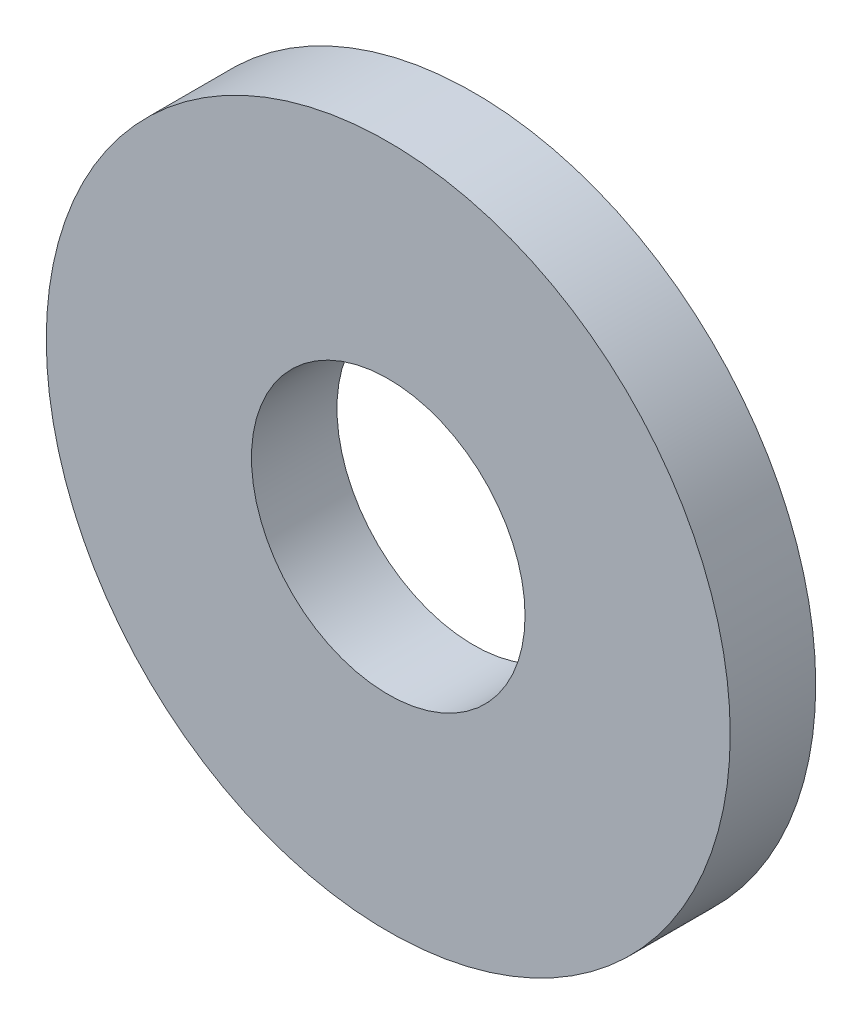
ISO-10303-21;
HEADER;
FILE_DESCRIPTION(('STEP AP214'),'2;1');
FILE_NAME('part.step','',(''),(''),'','','');
FILE_SCHEMA(('AUTOMOTIVE_DESIGN { 1 0 10303 214 1 1 1 1 }'));
ENDSEC;
DATA;
#1=APPLICATION_CONTEXT('core data for automotive mechanical design processes');
#2=APPLICATION_PROTOCOL_DEFINITION('international standard','automotive_design',2000,#1);
#3=PRODUCT_CONTEXT('',#1,'mechanical');
#4=PRODUCT('Part','Part','',(#3));
#5=PRODUCT_RELATED_PRODUCT_CATEGORY('part','',(#4));
#6=PRODUCT_DEFINITION_FORMATION('','',#4);
#7=PRODUCT_DEFINITION_CONTEXT('part definition',#1,'design');
#8=PRODUCT_DEFINITION('design','',#6,#7);
#9=PRODUCT_DEFINITION_SHAPE('','',#8);
#10=(LENGTH_UNIT() NAMED_UNIT(*) SI_UNIT(.MILLI.,.METRE.));
#11=(NAMED_UNIT(*) PLANE_ANGLE_UNIT() SI_UNIT($,.RADIAN.));
#12=(NAMED_UNIT(*) SI_UNIT($,.STERADIAN.) SOLID_ANGLE_UNIT());
#13=UNCERTAINTY_MEASURE_WITH_UNIT(LENGTH_MEASURE(1.E-05),#10,'distance_accuracy_value','');
#14=(GEOMETRIC_REPRESENTATION_CONTEXT(3) GLOBAL_UNCERTAINTY_ASSIGNED_CONTEXT((#13)) GLOBAL_UNIT_ASSIGNED_CONTEXT((#10,
#11,#12)) REPRESENTATION_CONTEXT('',''));
#15=CARTESIAN_POINT('',(0.,0.,0.));
#16=DIRECTION('',(0.,0.,1.));
#17=DIRECTION('',(1.,0.,0.));
#18=AXIS2_PLACEMENT_3D('',#15,#16,#17);
#19=CARTESIAN_POINT('',(0.,0.,1.));
#20=DIRECTION('',(0.,0.,1.));
#21=DIRECTION('',(1.,0.,0.));
#22=AXIS2_PLACEMENT_3D('',#19,#20,#21);
#23=PLANE('',#22);
#24=CARTESIAN_POINT('',(0.,0.,1.));
#25=DIRECTION('',(0.,0.,1.));
#26=DIRECTION('',(1.,0.,0.));
#27=AXIS2_PLACEMENT_3D('',#24,#25,#26);
#28=CIRCLE('',#27,4.);
#29=CARTESIAN_POINT('',(4.,0.,1.));
#30=VERTEX_POINT('',#29);
#31=EDGE_CURVE('E10',#30,#30,#28,.T.);
#32=ORIENTED_EDGE('',*,*,#31,.T.);
#33=EDGE_LOOP('',(#32));
#34=FACE_BOUND('',#33,.T.);
#35=CARTESIAN_POINT('',(0.,0.,1.));
#36=DIRECTION('',(0.,0.,1.));
#37=DIRECTION('',(1.,0.,0.));
#38=AXIS2_PLACEMENT_3D('',#35,#36,#37);
#39=CIRCLE('',#38,1.6);
#40=CARTESIAN_POINT('',(1.6,0.,1.));
#41=VERTEX_POINT('',#40);
#42=EDGE_CURVE('E35',#41,#41,#39,.T.);
#43=ORIENTED_EDGE('',*,*,#42,.F.);
#44=EDGE_LOOP('',(#43));
#45=FACE_BOUND('',#44,.T.);
#46=ADVANCED_FACE('F24',(#34,#45),#23,.T.);
#47=CARTESIAN_POINT('',(0.,0.,0.));
#48=DIRECTION('',(0.,0.,1.));
#49=DIRECTION('',(1.,0.,0.));
#50=AXIS2_PLACEMENT_3D('',#47,#48,#49);
#51=PLANE('',#50);
#52=CARTESIAN_POINT('',(0.,0.,0.));
#53=DIRECTION('',(0.,0.,1.));
#54=DIRECTION('',(1.,0.,0.));
#55=AXIS2_PLACEMENT_3D('',#52,#53,#54);
#56=CIRCLE('',#55,4.);
#57=CARTESIAN_POINT('',(4.,0.,0.));
#58=VERTEX_POINT('',#57);
#59=EDGE_CURVE('E31',#58,#58,#56,.T.);
#60=ORIENTED_EDGE('',*,*,#59,.F.);
#61=EDGE_LOOP('',(#60));
#62=FACE_BOUND('',#61,.T.);
#63=CARTESIAN_POINT('',(0.,0.,0.));
#64=DIRECTION('',(0.,0.,1.));
#65=DIRECTION('',(1.,0.,0.));
#66=AXIS2_PLACEMENT_3D('',#63,#64,#65);
#67=CIRCLE('',#66,1.6);
#68=CARTESIAN_POINT('',(1.6,0.,0.));
#69=VERTEX_POINT('',#68);
#70=EDGE_CURVE('E39',#69,#69,#67,.T.);
#71=ORIENTED_EDGE('',*,*,#70,.T.);
#72=EDGE_LOOP('',(#71));
#73=FACE_BOUND('',#72,.T.);
#74=ADVANCED_FACE('F45',(#62,#73),#51,.F.);
#75=CARTESIAN_POINT('',(0.,0.,1.));
#76=DIRECTION('',(0.,0.,-1.));
#77=DIRECTION('',(-1.,0.,0.));
#78=AXIS2_PLACEMENT_3D('',#75,#76,#77);
#79=CYLINDRICAL_SURFACE('',#78,4.);
#80=ORIENTED_EDGE('',*,*,#31,.F.);
#81=EDGE_LOOP('',(#80));
#82=FACE_BOUND('',#81,.T.);
#83=ORIENTED_EDGE('',*,*,#59,.T.);
#84=EDGE_LOOP('',(#83));
#85=FACE_BOUND('',#84,.T.);
#86=ADVANCED_FACE('F26',(#82,#85),#79,.T.);
#87=CARTESIAN_POINT('',(0.,0.,1.));
#88=DIRECTION('',(0.,0.,-1.));
#89=DIRECTION('',(-1.,0.,0.));
#90=AXIS2_PLACEMENT_3D('',#87,#88,#89);
#91=CYLINDRICAL_SURFACE('',#90,1.6);
#92=ORIENTED_EDGE('',*,*,#42,.T.);
#93=EDGE_LOOP('',(#92));
#94=FACE_BOUND('',#93,.T.);
#95=ORIENTED_EDGE('',*,*,#70,.F.);
#96=EDGE_LOOP('',(#95));
#97=FACE_BOUND('',#96,.T.);
#98=ADVANCED_FACE('F47',(#94,#97),#91,.F.);
#99=CLOSED_SHELL('',(#46,#74,#86,#98));
#100=MANIFOLD_SOLID_BREP('B2',#99);
#101=ADVANCED_BREP_SHAPE_REPRESENTATION('',(#18,#100),#14);
#102=SHAPE_DEFINITION_REPRESENTATION(#9,#101);
ENDSEC;
END-ISO-10303-21;
